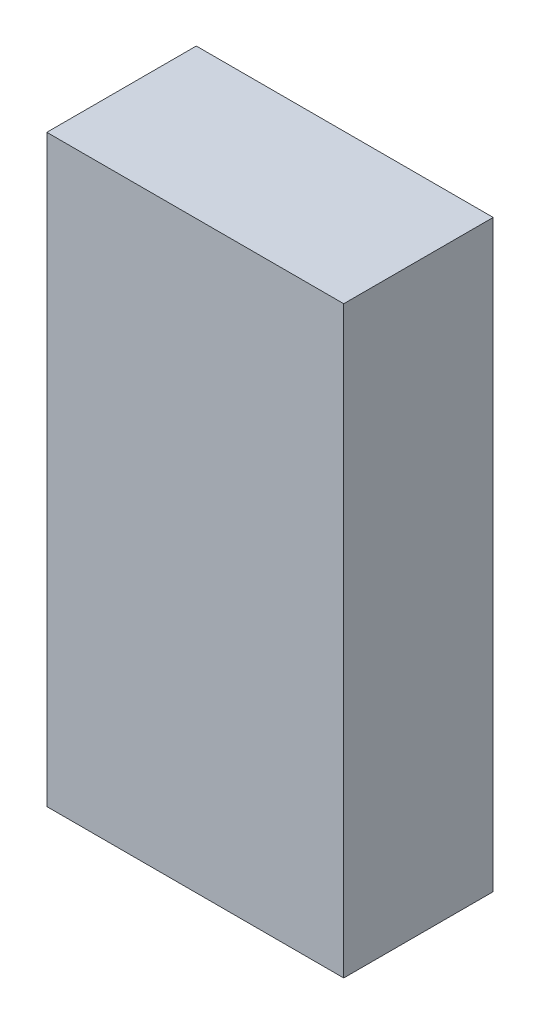
ISO-10303-21;
HEADER;
FILE_DESCRIPTION(('STEP AP214'),'2;1');
FILE_NAME('part.step','',(''),(''),'','','');
FILE_SCHEMA(('AUTOMOTIVE_DESIGN { 1 0 10303 214 1 1 1 1 }'));
ENDSEC;
DATA;
#1=APPLICATION_CONTEXT('core data for automotive mechanical design processes');
#2=APPLICATION_PROTOCOL_DEFINITION('international standard','automotive_design',2000,#1);
#3=PRODUCT_CONTEXT('',#1,'mechanical');
#4=PRODUCT('Part','Part','',(#3));
#5=PRODUCT_RELATED_PRODUCT_CATEGORY('part','',(#4));
#6=PRODUCT_DEFINITION_FORMATION('','',#4);
#7=PRODUCT_DEFINITION_CONTEXT('part definition',#1,'design');
#8=PRODUCT_DEFINITION('design','',#6,#7);
#9=PRODUCT_DEFINITION_SHAPE('','',#8);
#10=(LENGTH_UNIT() NAMED_UNIT(*) SI_UNIT(.MILLI.,.METRE.));
#11=(NAMED_UNIT(*) PLANE_ANGLE_UNIT() SI_UNIT($,.RADIAN.));
#12=(NAMED_UNIT(*) SI_UNIT($,.STERADIAN.) SOLID_ANGLE_UNIT());
#13=UNCERTAINTY_MEASURE_WITH_UNIT(LENGTH_MEASURE(1.E-05),#10,'distance_accuracy_value','');
#14=(GEOMETRIC_REPRESENTATION_CONTEXT(3) GLOBAL_UNCERTAINTY_ASSIGNED_CONTEXT((#13)) GLOBAL_UNIT_ASSIGNED_CONTEXT((#10,
#11,#12)) REPRESENTATION_CONTEXT('',''));
#15=CARTESIAN_POINT('',(0.,0.,0.));
#16=DIRECTION('',(0.,0.,1.));
#17=DIRECTION('',(1.,0.,0.));
#18=AXIS2_PLACEMENT_3D('',#15,#16,#17);
#19=CARTESIAN_POINT('',(-96.0624636090297,65.0086956521739,43.));
#20=DIRECTION('',(1.,0.,0.));
#21=DIRECTION('',(0.,0.,-1.));
#22=AXIS2_PLACEMENT_3D('',#19,#20,#21);
#23=PLANE('',#22);
#24=DIRECTION('',(0.,-1.,0.));
#25=VECTOR('',#24,1.);
#26=CARTESIAN_POINT('',(-96.0624636090297,65.0086956521739,0.));
#27=LINE('',#26,#25);
#28=CARTESIAN_POINT('',(-96.0624636090297,65.0086956521739,0.));
#29=VERTEX_POINT('',#28);
#30=CARTESIAN_POINT('',(-96.0624636090297,-102.991304347826,0.));
#31=VERTEX_POINT('',#30);
#32=EDGE_CURVE('E97',#29,#31,#27,.T.);
#33=ORIENTED_EDGE('',*,*,#32,.T.);
#34=DIRECTION('',(0.,0.,-1.));
#35=VECTOR('',#34,1.);
#36=CARTESIAN_POINT('',(-96.0624636090297,-102.991304347826,43.));
#37=LINE('',#36,#35);
#38=CARTESIAN_POINT('',(-96.0624636090297,-102.991304347826,43.));
#39=VERTEX_POINT('',#38);
#40=EDGE_CURVE('E11',#39,#31,#37,.T.);
#41=ORIENTED_EDGE('',*,*,#40,.F.);
#42=DIRECTION('',(0.,-1.,0.));
#43=VECTOR('',#42,1.);
#44=CARTESIAN_POINT('',(-96.0624636090297,65.0086956521739,43.));
#45=LINE('',#44,#43);
#46=CARTESIAN_POINT('',(-96.0624636090297,65.0086956521739,43.));
#47=VERTEX_POINT('',#46);
#48=EDGE_CURVE('E85',#47,#39,#45,.T.);
#49=ORIENTED_EDGE('',*,*,#48,.F.);
#50=DIRECTION('',(0.,0.,-1.));
#51=VECTOR('',#50,1.);
#52=CARTESIAN_POINT('',(-96.0624636090297,65.0086956521739,43.));
#53=LINE('',#52,#51);
#54=EDGE_CURVE('E93',#47,#29,#53,.T.);
#55=ORIENTED_EDGE('',*,*,#54,.T.);
#56=EDGE_LOOP('',(#33,#41,#49,#55));
#57=FACE_BOUND('',#56,.T.);
#58=ADVANCED_FACE('F34',(#57),#23,.F.);
#59=CARTESIAN_POINT('',(-96.0624636090297,-102.991304347826,43.));
#60=DIRECTION('',(0.,1.,0.));
#61=DIRECTION('',(0.,0.,1.));
#62=AXIS2_PLACEMENT_3D('',#59,#60,#61);
#63=PLANE('',#62);
#64=DIRECTION('',(1.,0.,0.));
#65=VECTOR('',#64,1.);
#66=CARTESIAN_POINT('',(-96.0624636090297,-102.991304347826,0.));
#67=LINE('',#66,#65);
#68=CARTESIAN_POINT('',(-10.6424636090297,-102.991304347826,0.));
#69=VERTEX_POINT('',#68);
#70=EDGE_CURVE('E89',#31,#69,#67,.T.);
#71=ORIENTED_EDGE('',*,*,#70,.T.);
#72=DIRECTION('',(0.,0.,-1.));
#73=VECTOR('',#72,1.);
#74=CARTESIAN_POINT('',(-10.6424636090297,-102.991304347826,43.));
#75=LINE('',#74,#73);
#76=CARTESIAN_POINT('',(-10.6424636090297,-102.991304347826,43.));
#77=VERTEX_POINT('',#76);
#78=EDGE_CURVE('E42',#77,#69,#75,.T.);
#79=ORIENTED_EDGE('',*,*,#78,.F.);
#80=DIRECTION('',(1.,0.,0.));
#81=VECTOR('',#80,1.);
#82=CARTESIAN_POINT('',(-96.0624636090297,-102.991304347826,43.));
#83=LINE('',#82,#81);
#84=EDGE_CURVE('E80',#39,#77,#83,.T.);
#85=ORIENTED_EDGE('',*,*,#84,.F.);
#86=ORIENTED_EDGE('',*,*,#40,.T.);
#87=EDGE_LOOP('',(#71,#79,#85,#86));
#88=FACE_BOUND('',#87,.T.);
#89=ADVANCED_FACE('F88',(#88),#63,.F.);
#90=CARTESIAN_POINT('',(-10.6424636090297,65.0086956521739,43.));
#91=DIRECTION('',(-1.,0.,0.));
#92=DIRECTION('',(0.,-1.,0.));
#93=AXIS2_PLACEMENT_3D('',#90,#91,#92);
#94=PLANE('',#93);
#95=DIRECTION('',(0.,1.,0.));
#96=VECTOR('',#95,1.);
#97=CARTESIAN_POINT('',(-10.6424636090297,65.0086956521739,0.));
#98=LINE('',#97,#96);
#99=CARTESIAN_POINT('',(-10.6424636090297,65.0086956521739,0.));
#100=VERTEX_POINT('',#99);
#101=EDGE_CURVE('E67',#69,#100,#98,.T.);
#102=ORIENTED_EDGE('',*,*,#101,.T.);
#103=DIRECTION('',(0.,0.,-1.));
#104=VECTOR('',#103,1.);
#105=CARTESIAN_POINT('',(-10.6424636090297,65.0086956521739,43.));
#106=LINE('',#105,#104);
#107=CARTESIAN_POINT('',(-10.6424636090297,65.0086956521739,43.));
#108=VERTEX_POINT('',#107);
#109=EDGE_CURVE('E90',#108,#100,#106,.T.);
#110=ORIENTED_EDGE('',*,*,#109,.F.);
#111=DIRECTION('',(0.,1.,0.));
#112=VECTOR('',#111,1.);
#113=CARTESIAN_POINT('',(-10.6424636090297,65.0086956521739,43.));
#114=LINE('',#113,#112);
#115=EDGE_CURVE('E83',#77,#108,#114,.T.);
#116=ORIENTED_EDGE('',*,*,#115,.F.);
#117=ORIENTED_EDGE('',*,*,#78,.T.);
#118=EDGE_LOOP('',(#102,#110,#116,#117));
#119=FACE_BOUND('',#118,.T.);
#120=ADVANCED_FACE('F91',(#119),#94,.F.);
#121=CARTESIAN_POINT('',(-96.0624636090297,65.0086956521739,43.));
#122=DIRECTION('',(0.,-1.,0.));
#123=DIRECTION('',(0.,0.,-1.));
#124=AXIS2_PLACEMENT_3D('',#121,#122,#123);
#125=PLANE('',#124);
#126=DIRECTION('',(-1.,0.,0.));
#127=VECTOR('',#126,1.);
#128=CARTESIAN_POINT('',(-96.0624636090297,65.0086956521739,0.));
#129=LINE('',#128,#127);
#130=EDGE_CURVE('E73',#100,#29,#129,.T.);
#131=ORIENTED_EDGE('',*,*,#130,.T.);
#132=ORIENTED_EDGE('',*,*,#54,.F.);
#133=DIRECTION('',(-1.,0.,0.));
#134=VECTOR('',#133,1.);
#135=CARTESIAN_POINT('',(-96.0624636090297,65.0086956521739,43.));
#136=LINE('',#135,#134);
#137=EDGE_CURVE('E50',#108,#47,#136,.T.);
#138=ORIENTED_EDGE('',*,*,#137,.F.);
#139=ORIENTED_EDGE('',*,*,#109,.T.);
#140=EDGE_LOOP('',(#131,#132,#138,#139));
#141=FACE_BOUND('',#140,.T.);
#142=ADVANCED_FACE('F104',(#141),#125,.F.);
#143=CARTESIAN_POINT('',(0.,0.,43.));
#144=DIRECTION('',(0.,0.,1.));
#145=DIRECTION('',(1.,0.,0.));
#146=AXIS2_PLACEMENT_3D('',#143,#144,#145);
#147=PLANE('',#146);
#148=ORIENTED_EDGE('',*,*,#48,.T.);
#149=ORIENTED_EDGE('',*,*,#84,.T.);
#150=ORIENTED_EDGE('',*,*,#115,.T.);
#151=ORIENTED_EDGE('',*,*,#137,.T.);
#152=EDGE_LOOP('',(#148,#149,#150,#151));
#153=FACE_BOUND('',#152,.T.);
#154=ADVANCED_FACE('F81',(#153),#147,.T.);
#155=CARTESIAN_POINT('',(0.,0.,0.));
#156=DIRECTION('',(0.,0.,1.));
#157=DIRECTION('',(1.,0.,0.));
#158=AXIS2_PLACEMENT_3D('',#155,#156,#157);
#159=PLANE('',#158);
#160=ORIENTED_EDGE('',*,*,#32,.F.);
#161=ORIENTED_EDGE('',*,*,#130,.F.);
#162=ORIENTED_EDGE('',*,*,#101,.F.);
#163=ORIENTED_EDGE('',*,*,#70,.F.);
#164=EDGE_LOOP('',(#160,#161,#162,#163));
#165=FACE_BOUND('',#164,.T.);
#166=ADVANCED_FACE('F107',(#165),#159,.F.);
#167=CLOSED_SHELL('',(#58,#89,#120,#142,#154,#166));
#168=MANIFOLD_SOLID_BREP('B2',#167);
#169=ADVANCED_BREP_SHAPE_REPRESENTATION('',(#18,#168),#14);
#170=SHAPE_DEFINITION_REPRESENTATION(#9,#169);
ENDSEC;
END-ISO-10303-21;
